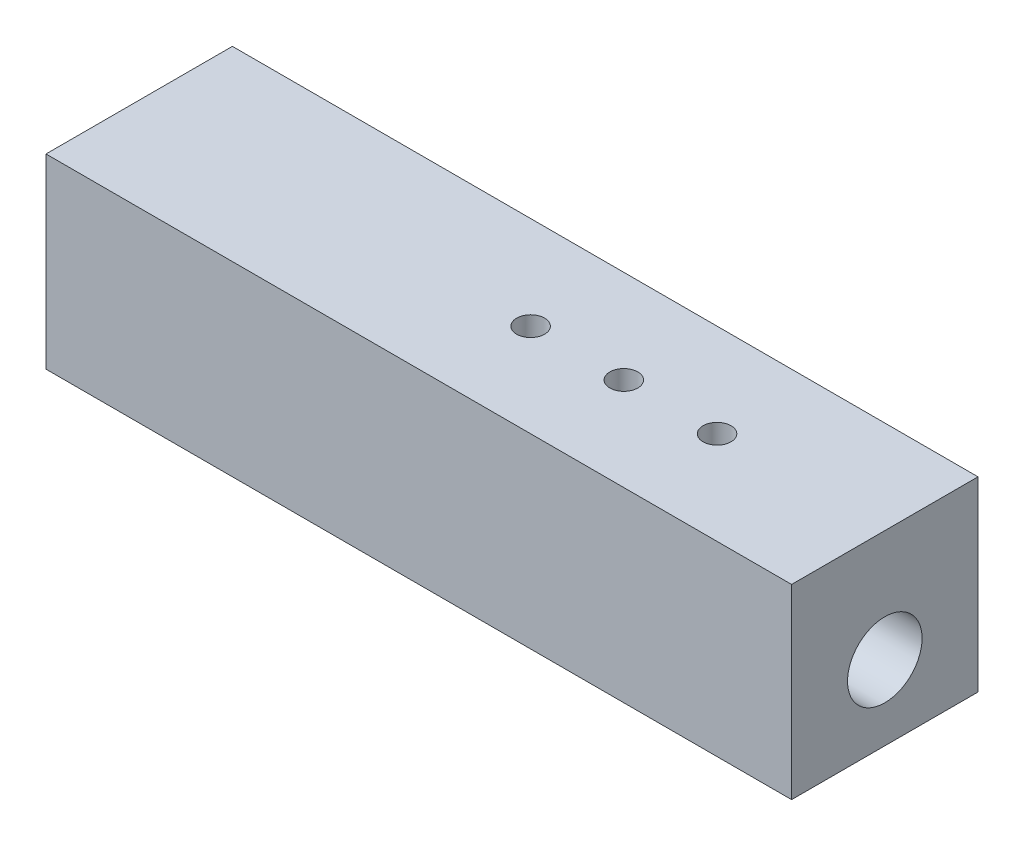
ISO-10303-21;
HEADER;
FILE_DESCRIPTION(('STEP AP214'),'2;1');
FILE_NAME('part.step','',(''),(''),'','','');
FILE_SCHEMA(('AUTOMOTIVE_DESIGN { 1 0 10303 214 1 1 1 1 }'));
ENDSEC;
DATA;
#1=APPLICATION_CONTEXT('core data for automotive mechanical design processes');
#2=APPLICATION_PROTOCOL_DEFINITION('international standard','automotive_design',2000,#1);
#3=PRODUCT_CONTEXT('',#1,'mechanical');
#4=PRODUCT('Part','Part','',(#3));
#5=PRODUCT_RELATED_PRODUCT_CATEGORY('part','',(#4));
#6=PRODUCT_DEFINITION_FORMATION('','',#4);
#7=PRODUCT_DEFINITION_CONTEXT('part definition',#1,'design');
#8=PRODUCT_DEFINITION('design','',#6,#7);
#9=PRODUCT_DEFINITION_SHAPE('','',#8);
#10=(LENGTH_UNIT() NAMED_UNIT(*) SI_UNIT(.MILLI.,.METRE.));
#11=(NAMED_UNIT(*) PLANE_ANGLE_UNIT() SI_UNIT($,.RADIAN.));
#12=(NAMED_UNIT(*) SI_UNIT($,.STERADIAN.) SOLID_ANGLE_UNIT());
#13=UNCERTAINTY_MEASURE_WITH_UNIT(LENGTH_MEASURE(1.E-05),#10,'distance_accuracy_value','');
#14=(GEOMETRIC_REPRESENTATION_CONTEXT(3) GLOBAL_UNCERTAINTY_ASSIGNED_CONTEXT((#13)) GLOBAL_UNIT_ASSIGNED_CONTEXT((#10,
#11,#12)) REPRESENTATION_CONTEXT('',''));
#15=CARTESIAN_POINT('',(0.,0.,0.));
#16=DIRECTION('',(0.,0.,1.));
#17=DIRECTION('',(1.,0.,0.));
#18=AXIS2_PLACEMENT_3D('',#15,#16,#17);
#19=CARTESIAN_POINT('',(-20.,10.,-5.));
#20=DIRECTION('',(1.,0.,0.));
#21=DIRECTION('',(0.,0.,-1.));
#22=AXIS2_PLACEMENT_3D('',#19,#20,#21);
#23=PLANE('',#22);
#24=CARTESIAN_POINT('',(-20.,4.,0.));
#25=DIRECTION('',(1.,0.,0.));
#26=DIRECTION('',(0.,0.,-1.));
#27=AXIS2_PLACEMENT_3D('',#24,#25,#26);
#28=CIRCLE('',#27,2.);
#29=CARTESIAN_POINT('',(-20.,4.,-2.));
#30=VERTEX_POINT('',#29);
#31=EDGE_CURVE('E99',#30,#30,#28,.T.);
#32=ORIENTED_EDGE('',*,*,#31,.T.);
#33=EDGE_LOOP('',(#32));
#34=FACE_BOUND('',#33,.T.);
#35=DIRECTION('',(0.,0.,1.));
#36=VECTOR('',#35,1.);
#37=CARTESIAN_POINT('',(-20.,0.,-5.));
#38=LINE('',#37,#36);
#39=CARTESIAN_POINT('',(-20.,0.,-5.));
#40=VERTEX_POINT('',#39);
#41=CARTESIAN_POINT('',(-20.,0.,5.));
#42=VERTEX_POINT('',#41);
#43=EDGE_CURVE('E96',#40,#42,#38,.T.);
#44=ORIENTED_EDGE('',*,*,#43,.T.);
#45=DIRECTION('',(0.,-1.,0.));
#46=VECTOR('',#45,1.);
#47=CARTESIAN_POINT('',(-20.,10.,5.));
#48=LINE('',#47,#46);
#49=CARTESIAN_POINT('',(-20.,10.,5.));
#50=VERTEX_POINT('',#49);
#51=EDGE_CURVE('E11',#50,#42,#48,.T.);
#52=ORIENTED_EDGE('',*,*,#51,.F.);
#53=DIRECTION('',(0.,0.,1.));
#54=VECTOR('',#53,1.);
#55=CARTESIAN_POINT('',(-20.,10.,-5.));
#56=LINE('',#55,#54);
#57=CARTESIAN_POINT('',(-20.,10.,-5.));
#58=VERTEX_POINT('',#57);
#59=EDGE_CURVE('E84',#58,#50,#56,.T.);
#60=ORIENTED_EDGE('',*,*,#59,.F.);
#61=DIRECTION('',(0.,-1.,0.));
#62=VECTOR('',#61,1.);
#63=CARTESIAN_POINT('',(-20.,10.,-5.));
#64=LINE('',#63,#62);
#65=EDGE_CURVE('E92',#58,#40,#64,.T.);
#66=ORIENTED_EDGE('',*,*,#65,.T.);
#67=EDGE_LOOP('',(#44,#52,#60,#66));
#68=FACE_BOUND('',#67,.T.);
#69=ADVANCED_FACE('F33',(#34,#68),#23,.F.);
#70=CARTESIAN_POINT('',(20.,10.,5.));
#71=DIRECTION('',(0.,0.,-1.));
#72=DIRECTION('',(-1.,0.,0.));
#73=AXIS2_PLACEMENT_3D('',#70,#71,#72);
#74=PLANE('',#73);
#75=DIRECTION('',(1.,0.,0.));
#76=VECTOR('',#75,1.);
#77=CARTESIAN_POINT('',(20.,0.,5.));
#78=LINE('',#77,#76);
#79=CARTESIAN_POINT('',(20.,0.,5.));
#80=VERTEX_POINT('',#79);
#81=EDGE_CURVE('E88',#42,#80,#78,.T.);
#82=ORIENTED_EDGE('',*,*,#81,.T.);
#83=DIRECTION('',(0.,-1.,0.));
#84=VECTOR('',#83,1.);
#85=CARTESIAN_POINT('',(20.,10.,5.));
#86=LINE('',#85,#84);
#87=CARTESIAN_POINT('',(20.,10.,5.));
#88=VERTEX_POINT('',#87);
#89=EDGE_CURVE('E41',#88,#80,#86,.T.);
#90=ORIENTED_EDGE('',*,*,#89,.F.);
#91=DIRECTION('',(1.,0.,0.));
#92=VECTOR('',#91,1.);
#93=CARTESIAN_POINT('',(20.,10.,5.));
#94=LINE('',#93,#92);
#95=EDGE_CURVE('E79',#50,#88,#94,.T.);
#96=ORIENTED_EDGE('',*,*,#95,.F.);
#97=ORIENTED_EDGE('',*,*,#51,.T.);
#98=EDGE_LOOP('',(#82,#90,#96,#97));
#99=FACE_BOUND('',#98,.T.);
#100=ADVANCED_FACE('F87',(#99),#74,.F.);
#101=CARTESIAN_POINT('',(20.,10.,-5.));
#102=DIRECTION('',(-1.,0.,0.));
#103=DIRECTION('',(0.,0.,1.));
#104=AXIS2_PLACEMENT_3D('',#101,#102,#103);
#105=PLANE('',#104);
#106=CARTESIAN_POINT('',(20.,4.,0.));
#107=DIRECTION('',(1.,0.,0.));
#108=DIRECTION('',(0.,0.,-1.));
#109=AXIS2_PLACEMENT_3D('',#106,#107,#108);
#110=CIRCLE('',#109,2.);
#111=CARTESIAN_POINT('',(20.,4.,-2.));
#112=VERTEX_POINT('',#111);
#113=EDGE_CURVE('E110',#112,#112,#110,.T.);
#114=ORIENTED_EDGE('',*,*,#113,.F.);
#115=EDGE_LOOP('',(#114));
#116=FACE_BOUND('',#115,.T.);
#117=DIRECTION('',(0.,0.,-1.));
#118=VECTOR('',#117,1.);
#119=CARTESIAN_POINT('',(20.,0.,-5.));
#120=LINE('',#119,#118);
#121=CARTESIAN_POINT('',(20.,0.,-5.));
#122=VERTEX_POINT('',#121);
#123=EDGE_CURVE('E66',#80,#122,#120,.T.);
#124=ORIENTED_EDGE('',*,*,#123,.T.);
#125=DIRECTION('',(0.,-1.,0.));
#126=VECTOR('',#125,1.);
#127=CARTESIAN_POINT('',(20.,10.,-5.));
#128=LINE('',#127,#126);
#129=CARTESIAN_POINT('',(20.,10.,-5.));
#130=VERTEX_POINT('',#129);
#131=EDGE_CURVE('E89',#130,#122,#128,.T.);
#132=ORIENTED_EDGE('',*,*,#131,.F.);
#133=DIRECTION('',(0.,0.,-1.));
#134=VECTOR('',#133,1.);
#135=CARTESIAN_POINT('',(20.,10.,-5.));
#136=LINE('',#135,#134);
#137=EDGE_CURVE('E82',#88,#130,#136,.T.);
#138=ORIENTED_EDGE('',*,*,#137,.F.);
#139=ORIENTED_EDGE('',*,*,#89,.T.);
#140=EDGE_LOOP('',(#124,#132,#138,#139));
#141=FACE_BOUND('',#140,.T.);
#142=ADVANCED_FACE('F90',(#116,#141),#105,.F.);
#143=CARTESIAN_POINT('',(20.,10.,-5.));
#144=DIRECTION('',(0.,0.,1.));
#145=DIRECTION('',(1.,0.,0.));
#146=AXIS2_PLACEMENT_3D('',#143,#144,#145);
#147=PLANE('',#146);
#148=DIRECTION('',(-1.,0.,0.));
#149=VECTOR('',#148,1.);
#150=CARTESIAN_POINT('',(20.,0.,-5.));
#151=LINE('',#150,#149);
#152=EDGE_CURVE('E72',#122,#40,#151,.T.);
#153=ORIENTED_EDGE('',*,*,#152,.T.);
#154=ORIENTED_EDGE('',*,*,#65,.F.);
#155=DIRECTION('',(-1.,0.,0.));
#156=VECTOR('',#155,1.);
#157=CARTESIAN_POINT('',(20.,10.,-5.));
#158=LINE('',#157,#156);
#159=EDGE_CURVE('E49',#130,#58,#158,.T.);
#160=ORIENTED_EDGE('',*,*,#159,.F.);
#161=ORIENTED_EDGE('',*,*,#131,.T.);
#162=EDGE_LOOP('',(#153,#154,#160,#161));
#163=FACE_BOUND('',#162,.T.);
#164=ADVANCED_FACE('F104',(#163),#147,.F.);
#165=CARTESIAN_POINT('',(0.,10.,0.));
#166=DIRECTION('',(0.,-1.,0.));
#167=DIRECTION('',(0.,0.,-1.));
#168=AXIS2_PLACEMENT_3D('',#165,#166,#167);
#169=PLANE('',#168);
#170=CARTESIAN_POINT('',(11.,10.,0.));
#171=DIRECTION('',(0.,1.,0.));
#172=DIRECTION('',(0.,0.,1.));
#173=AXIS2_PLACEMENT_3D('',#170,#171,#172);
#174=CIRCLE('',#173,0.75);
#175=CARTESIAN_POINT('',(11.,10.,0.75));
#176=VERTEX_POINT('',#175);
#177=EDGE_CURVE('E113',#176,#176,#174,.T.);
#178=ORIENTED_EDGE('',*,*,#177,.F.);
#179=EDGE_LOOP('',(#178));
#180=FACE_BOUND('',#179,.T.);
#181=CARTESIAN_POINT('',(6.,10.,0.));
#182=DIRECTION('',(0.,1.,0.));
#183=DIRECTION('',(0.,0.,1.));
#184=AXIS2_PLACEMENT_3D('',#181,#182,#183);
#185=CIRCLE('',#184,0.750000000000001);
#186=CARTESIAN_POINT('',(6.,10.,0.750000000000001));
#187=VERTEX_POINT('',#186);
#188=EDGE_CURVE('E127',#187,#187,#185,.T.);
#189=ORIENTED_EDGE('',*,*,#188,.F.);
#190=EDGE_LOOP('',(#189));
#191=FACE_BOUND('',#190,.T.);
#192=CARTESIAN_POINT('',(1.,10.,0.));
#193=DIRECTION('',(0.,1.,0.));
#194=DIRECTION('',(0.,0.,1.));
#195=AXIS2_PLACEMENT_3D('',#192,#193,#194);
#196=CIRCLE('',#195,0.75);
#197=CARTESIAN_POINT('',(1.,10.,0.75));
#198=VERTEX_POINT('',#197);
#199=EDGE_CURVE('E116',#198,#198,#196,.T.);
#200=ORIENTED_EDGE('',*,*,#199,.F.);
#201=EDGE_LOOP('',(#200));
#202=FACE_BOUND('',#201,.T.);
#203=ORIENTED_EDGE('',*,*,#59,.T.);
#204=ORIENTED_EDGE('',*,*,#95,.T.);
#205=ORIENTED_EDGE('',*,*,#137,.T.);
#206=ORIENTED_EDGE('',*,*,#159,.T.);
#207=EDGE_LOOP('',(#203,#204,#205,#206));
#208=FACE_BOUND('',#207,.T.);
#209=ADVANCED_FACE('F80',(#180,#191,#202,#208),#169,.F.);
#210=CARTESIAN_POINT('',(0.,0.,0.));
#211=DIRECTION('',(0.,-1.,0.));
#212=DIRECTION('',(0.,0.,-1.));
#213=AXIS2_PLACEMENT_3D('',#210,#211,#212);
#214=PLANE('',#213);
#215=ORIENTED_EDGE('',*,*,#43,.F.);
#216=ORIENTED_EDGE('',*,*,#152,.F.);
#217=ORIENTED_EDGE('',*,*,#123,.F.);
#218=ORIENTED_EDGE('',*,*,#81,.F.);
#219=EDGE_LOOP('',(#215,#216,#217,#218));
#220=FACE_BOUND('',#219,.T.);
#221=ADVANCED_FACE('F107',(#220),#214,.T.);
#222=CARTESIAN_POINT('',(-20.,4.,0.));
#223=DIRECTION('',(1.,0.,0.));
#224=DIRECTION('',(0.,0.,-1.));
#225=AXIS2_PLACEMENT_3D('',#222,#223,#224);
#226=CYLINDRICAL_SURFACE('',#225,2.);
#227=CARTESIAN_POINT('',(11.,5.85404962177392,0.75));
#228=CARTESIAN_POINT('',(10.9594962581396,5.85404820316903,0.750001520530547));
#229=CARTESIAN_POINT('',(10.9190025387482,5.85539130120493,0.746707987747437));
#230=CARTESIAN_POINT('',(10.8392359585434,5.86058079652483,0.733680939477339));
#231=CARTESIAN_POINT('',(10.7999630612025,5.86442711883556,0.723947616866316));
#232=CARTESIAN_POINT('',(10.7238123141932,5.8741274014045,0.698448288052869));
#233=CARTESIAN_POINT('',(10.6869289716745,5.8799765478463,0.682696736331742));
#234=CARTESIAN_POINT('',(10.6163140515906,5.89301567103299,0.645659283713488));
#235=CARTESIAN_POINT('',(10.5825834248587,5.90020605033662,0.624371720475193));
#236=CARTESIAN_POINT('',(10.5175548441886,5.91551787332856,0.57573330687081));
#237=CARTESIAN_POINT('',(10.4864357351853,5.92366670961802,0.548151906066532));
#238=CARTESIAN_POINT('',(10.4291385926643,5.93974875314273,0.488197919889463));
#239=CARTESIAN_POINT('',(10.4029616131291,5.94768191407392,0.45582431512834));
#240=CARTESIAN_POINT('',(10.3554302438522,5.96276436968276,0.385847327588801));
#241=CARTESIAN_POINT('',(10.3342702626421,5.96987780611753,0.348103473769015));
#242=CARTESIAN_POINT('',(10.2986744137375,5.98219003986924,0.269277885982624));
#243=CARTESIAN_POINT('',(10.284236214004,5.98738950108503,0.228197315466768));
#244=CARTESIAN_POINT('',(10.2631210521127,5.9950934855172,0.145744670838416));
#245=CARTESIAN_POINT('',(10.2561361862798,5.99770457607387,0.104461598640798));
#246=CARTESIAN_POINT('',(10.2491393995275,6.0003200705397,0.021232181897393));
#247=CARTESIAN_POINT('',(10.2491252111906,6.00032532207451,-0.0207139425314167));
#248=CARTESIAN_POINT('',(10.2558908807326,5.99779632951947,-0.101871771532238));
#249=CARTESIAN_POINT('',(10.2623346489744,5.99538770998342,-0.14111608913345));
#250=CARTESIAN_POINT('',(10.2812679576128,5.98846637466131,-0.217919608992196));
#251=CARTESIAN_POINT('',(10.293757926131,5.98395350987789,-0.255478691715149));
#252=CARTESIAN_POINT('',(10.3245852258379,5.97318884583765,-0.328494508651552));
#253=CARTESIAN_POINT('',(10.3430050026342,5.96691269735038,-0.363912696143655));
#254=CARTESIAN_POINT('',(10.3850960484647,5.9532565511264,-0.43124330397878));
#255=CARTESIAN_POINT('',(10.4087690115088,5.9458761975642,-0.463154588466162));
#256=CARTESIAN_POINT('',(10.4623136431416,5.93026264827908,-0.524545243400468));
#257=CARTESIAN_POINT('',(10.4924669578252,5.92200481881941,-0.553773072631741));
#258=CARTESIAN_POINT('',(10.5572964966608,5.90591230322861,-0.606851977846712));
#259=CARTESIAN_POINT('',(10.5919738532933,5.89807772374424,-0.630701703464499));
#260=CARTESIAN_POINT('',(10.6658597337314,5.88356351750168,-0.672828059040758));
#261=CARTESIAN_POINT('',(10.705151746843,5.87691338575138,-0.690969239259154));
#262=CARTESIAN_POINT('',(10.7865481125838,5.86586219314501,-0.720282322207506));
#263=CARTESIAN_POINT('',(10.8286508857968,5.86145988102891,-0.731458103027975));
#264=CARTESIAN_POINT('',(10.911987981158,5.85569798611424,-0.745950958548341));
#265=CARTESIAN_POINT('',(10.9531420527681,5.85418392620768,-0.74966760579483));
#266=CARTESIAN_POINT('',(11.0355046783709,5.85393269762508,-0.750289428181361));
#267=CARTESIAN_POINT('',(11.0767132161762,5.85519483501993,-0.747196305468809));
#268=CARTESIAN_POINT('',(11.1559649611438,5.86019690814867,-0.734648667600785));
#269=CARTESIAN_POINT('',(11.1940655678823,5.86381638108224,-0.725503091671123));
#270=CARTESIAN_POINT('',(11.2681739723601,5.87298243523181,-0.701498873203188));
#271=CARTESIAN_POINT('',(11.3041813395841,5.87852941125086,-0.686639060173115));
#272=CARTESIAN_POINT('',(11.3745822190381,5.8911812155804,-0.651001461376389));
#273=CARTESIAN_POINT('',(11.4088646460687,5.89833664446032,-0.630022725885234));
#274=CARTESIAN_POINT('',(11.473564490863,5.91331407147146,-0.582956589312396));
#275=CARTESIAN_POINT('',(11.5039804873123,5.92113631297039,-0.556867318482174));
#276=CARTESIAN_POINT('',(11.5620841865976,5.93716523276592,-0.49836367045047));
#277=CARTESIAN_POINT('',(11.5894767043844,5.94536484678514,-0.465653170745532));
#278=CARTESIAN_POINT('',(11.6384191837947,5.96074937481651,-0.395898735876576));
#279=CARTESIAN_POINT('',(11.6599691264729,5.96793428553832,-0.358854786661337));
#280=CARTESIAN_POINT('',(11.6964730280998,5.98047492852276,-0.281508164734238));
#281=CARTESIAN_POINT('',(11.7114495618963,5.98583690669005,-0.241217216532313));
#282=CARTESIAN_POINT('',(11.734328206925,5.99414718356286,-0.158440943761627));
#283=CARTESIAN_POINT('',(11.7422336427112,5.99709661649706,-0.115956660361796));
#284=CARTESIAN_POINT('',(11.7503872013774,6.00014203658537,-0.0326677926369078));
#285=CARTESIAN_POINT('',(11.7510547415295,6.00039430476882,0.00809038403042252));
#286=CARTESIAN_POINT('',(11.7457924202773,5.99842444904612,0.0891133932062117));
#287=CARTESIAN_POINT('',(11.7398633545571,5.99620262356565,0.129378284622628));
#288=CARTESIAN_POINT('',(11.7218705742532,5.98960544801886,0.207274124188563));
#289=CARTESIAN_POINT('',(11.7099600470608,5.98528395689009,0.244945365534417));
#290=CARTESIAN_POINT('',(11.6804949933078,5.97493891810495,0.317757736503194));
#291=CARTESIAN_POINT('',(11.6629393983476,5.96891504827832,0.352898385637771));
#292=CARTESIAN_POINT('',(11.6218430282476,5.95545309150037,0.421270088497206));
#293=CARTESIAN_POINT('',(11.5980816797429,5.94796620054414,0.454358774423425));
#294=CARTESIAN_POINT('',(11.5455960849062,5.93249753847422,0.516208673761681));
#295=CARTESIAN_POINT('',(11.5168700670961,5.92451559137014,0.54496833562795));
#296=CARTESIAN_POINT('',(11.4534679341775,5.90844064869588,0.598906071180978));
#297=CARTESIAN_POINT('',(11.4185577989228,5.9003640267458,0.623814999080126));
#298=CARTESIAN_POINT('',(11.3447920652133,5.88549162501819,0.667423547784217));
#299=CARTESIAN_POINT('',(11.3059360579733,5.87869597815608,0.686122524390784));
#300=CARTESIAN_POINT('',(11.2235221595123,5.86701134926633,0.717329434871302));
#301=CARTESIAN_POINT('',(11.1798328167441,5.8622190164543,0.729530014497614));
#302=CARTESIAN_POINT('',(11.0907573640221,5.85573997168158,0.745861783610396));
#303=CARTESIAN_POINT('',(11.045372393645,5.85405121089868,0.749998296697853));
#304=CARTESIAN_POINT('',(11.,5.85404962177392,0.75));
#305=B_SPLINE_CURVE_WITH_KNOTS('',3,(#227,#228,#229,#230,#231,#232,#233,#234,#235,#236,#237,
#238,#239,#240,#241,#242,#243,#244,#245,#246,#247,#248,#249,#250,#251,#252,#253,#254,#255,#256,
#257,#258,#259,#260,#261,#262,#263,#264,#265,#266,#267,#268,#269,#270,#271,#272,#273,#274,#275,
#276,#277,#278,#279,#280,#281,#282,#283,#284,#285,#286,#287,#288,#289,#290,#291,#292,#293,#294,
#295,#296,#297,#298,#299,#300,#301,#302,#303,#304),.UNSPECIFIED.,.T.,.F.,(4,2,2,2,2,2,2,2,2,2,2,
2,2,2,2,2,2,2,2,2,2,2,2,2,2,2,2,2,2,2,2,2,2,2,2,2,2,2,4),(0.,0.121342270708086,
0.242680907299427,0.363729928378516,0.484815339841467,0.611373262005639,0.737958144114914,
0.868850360682105,0.99969713190665,1.1249000924484,1.25006232702429,1.36903236401597,
1.48801082631668,1.60872065605334,1.72946946814488,1.85728337532937,1.98512933913667,
2.11581296126483,2.24642375817737,2.36982828870243,2.49320197694442,2.61071922964099,
2.72826056714763,2.85020780502911,2.97219974233178,3.10192508496812,3.23165084825089,
3.36092754445084,3.49014342780064,3.61182860274968,3.7334991015974,3.85220137001945,
3.97092611756416,4.09464161838493,4.21840135447482,4.3486929977104,4.47899815272121,
4.61501589435463,4.75094381161527),.UNSPECIFIED.);
#306=CARTESIAN_POINT('',(11.,5.85404962177392,0.75));
#307=VERTEX_POINT('',#306);
#308=EDGE_CURVE('E148',#307,#307,#305,.T.);
#309=ORIENTED_EDGE('',*,*,#308,.F.);
#310=EDGE_LOOP('',(#309));
#311=FACE_BOUND('',#310,.T.);
#312=CARTESIAN_POINT('',(6.,5.85404962177392,0.750000000000001));
#313=CARTESIAN_POINT('',(5.95949625813961,5.85404820316903,0.750001520530547));
#314=CARTESIAN_POINT('',(5.91900253874818,5.85539130120493,0.746707987747437));
#315=CARTESIAN_POINT('',(5.8392359585434,5.86058079652483,0.73368093947734));
#316=CARTESIAN_POINT('',(5.79996306120249,5.86442711883556,0.723947616866317));
#317=CARTESIAN_POINT('',(5.72381231419324,5.8741274014045,0.69844828805287));
#318=CARTESIAN_POINT('',(5.68692897167446,5.8799765478463,0.682696736331742));
#319=CARTESIAN_POINT('',(5.61631405159058,5.89301567103299,0.645659283713488));
#320=CARTESIAN_POINT('',(5.58258342485874,5.90020605033662,0.624371720475193));
#321=CARTESIAN_POINT('',(5.51755484418859,5.91551787332856,0.57573330687081));
#322=CARTESIAN_POINT('',(5.4864357351853,5.92366670961802,0.548151906066531));
#323=CARTESIAN_POINT('',(5.42913859266426,5.93974875314273,0.488197919889463));
#324=CARTESIAN_POINT('',(5.40296161312907,5.94768191407393,0.45582431512834));
#325=CARTESIAN_POINT('',(5.35543024385219,5.96276436968277,0.3858473275888));
#326=CARTESIAN_POINT('',(5.33427026264207,5.96987780611753,0.348103473769014));
#327=CARTESIAN_POINT('',(5.29867441373754,5.98219003986924,0.269277885982623));
#328=CARTESIAN_POINT('',(5.28423621400401,5.98738950108503,0.228197315466767));
#329=CARTESIAN_POINT('',(5.26312105211269,5.9950934855172,0.145744670838415));
#330=CARTESIAN_POINT('',(5.25613618627977,5.99770457607387,0.104461598640797));
#331=CARTESIAN_POINT('',(5.24913939952751,6.0003200705397,0.0212321818973921));
#332=CARTESIAN_POINT('',(5.24912521119064,6.00032532207451,-0.0207139425314175));
#333=CARTESIAN_POINT('',(5.25589088073259,5.99779632951947,-0.101871771532239));
#334=CARTESIAN_POINT('',(5.26233464897441,5.99538770998342,-0.141116089133451));
#335=CARTESIAN_POINT('',(5.28126795761278,5.98846637466131,-0.217919608992197));
#336=CARTESIAN_POINT('',(5.29375792613102,5.98395350987789,-0.25547869171515));
#337=CARTESIAN_POINT('',(5.32458522583792,5.97318884583765,-0.328494508651553));
#338=CARTESIAN_POINT('',(5.3430050026342,5.96691269735038,-0.363912696143656));
#339=CARTESIAN_POINT('',(5.38509604846469,5.9532565511264,-0.431243303978781));
#340=CARTESIAN_POINT('',(5.4087690115088,5.9458761975642,-0.463154588466163));
#341=CARTESIAN_POINT('',(5.46231364314159,5.93026264827908,-0.524545243400469));
#342=CARTESIAN_POINT('',(5.49246695782521,5.92200481881941,-0.553773072631741));
#343=CARTESIAN_POINT('',(5.55729649666078,5.90591230322861,-0.606851977846713));
#344=CARTESIAN_POINT('',(5.59197385329332,5.89807772374424,-0.6307017034645));
#345=CARTESIAN_POINT('',(5.66585973373141,5.88356351750168,-0.672828059040759));
#346=CARTESIAN_POINT('',(5.70515174684303,5.87691338575138,-0.690969239259155));
#347=CARTESIAN_POINT('',(5.78654811258379,5.86586219314501,-0.720282322207507));
#348=CARTESIAN_POINT('',(5.82865088579685,5.86145988102891,-0.731458103027976));
#349=CARTESIAN_POINT('',(5.91198798115798,5.85569798611424,-0.745950958548342));
#350=CARTESIAN_POINT('',(5.95314205276807,5.85418392620768,-0.749667605794831));
#351=CARTESIAN_POINT('',(6.03550467837087,5.85393269762508,-0.750289428181362));
#352=CARTESIAN_POINT('',(6.07671321617624,5.85519483501993,-0.74719630546881));
#353=CARTESIAN_POINT('',(6.15596496114384,5.86019690814867,-0.734648667600785));
#354=CARTESIAN_POINT('',(6.19406556788233,5.86381638108224,-0.725503091671123));
#355=CARTESIAN_POINT('',(6.2681739723601,5.87298243523181,-0.701498873203188));
#356=CARTESIAN_POINT('',(6.30418133958407,5.87852941125086,-0.686639060173115));
#357=CARTESIAN_POINT('',(6.37458221903811,5.8911812155804,-0.651001461376389));
#358=CARTESIAN_POINT('',(6.40886464606867,5.89833664446032,-0.630022725885234));
#359=CARTESIAN_POINT('',(6.47356449086302,5.91331407147146,-0.582956589312395));
#360=CARTESIAN_POINT('',(6.50398048731232,5.92113631297039,-0.556867318482173));
#361=CARTESIAN_POINT('',(6.56208418659755,5.93716523276592,-0.498363670450469));
#362=CARTESIAN_POINT('',(6.58947670438438,5.94536484678514,-0.46565317074553));
#363=CARTESIAN_POINT('',(6.63841918379472,5.96074937481651,-0.395898735876575));
#364=CARTESIAN_POINT('',(6.65996912647292,5.96793428553832,-0.358854786661337));
#365=CARTESIAN_POINT('',(6.69647302809981,5.98047492852276,-0.281508164734239));
#366=CARTESIAN_POINT('',(6.7114495618963,5.98583690669005,-0.241217216532313));
#367=CARTESIAN_POINT('',(6.73432820692496,5.99414718356286,-0.158440943761627));
#368=CARTESIAN_POINT('',(6.7422336427112,5.99709661649706,-0.115956660361796));
#369=CARTESIAN_POINT('',(6.75038720137742,6.00014203658537,-0.0326677926369073));
#370=CARTESIAN_POINT('',(6.7510547415295,6.00039430476882,0.00809038403042297));
#371=CARTESIAN_POINT('',(6.7457924202773,5.99842444904612,0.0891133932062123));
#372=CARTESIAN_POINT('',(6.73986335455707,5.99620262356565,0.129378284622629));
#373=CARTESIAN_POINT('',(6.72187057425319,5.98960544801886,0.207274124188564));
#374=CARTESIAN_POINT('',(6.70996004706082,5.98528395689009,0.244945365534418));
#375=CARTESIAN_POINT('',(6.68049499330782,5.97493891810495,0.317757736503196));
#376=CARTESIAN_POINT('',(6.66293939834762,5.96891504827832,0.352898385637772));
#377=CARTESIAN_POINT('',(6.6218430282476,5.95545309150037,0.421270088497207));
#378=CARTESIAN_POINT('',(6.59808167974293,5.94796620054414,0.454358774423426));
#379=CARTESIAN_POINT('',(6.5455960849062,5.93249753847422,0.516208673761682));
#380=CARTESIAN_POINT('',(6.51687006709606,5.92451559137013,0.54496833562795));
#381=CARTESIAN_POINT('',(6.45346793417747,5.90844064869588,0.598906071180979));
#382=CARTESIAN_POINT('',(6.41855779892285,5.9003640267458,0.623814999080126));
#383=CARTESIAN_POINT('',(6.34479206521334,5.88549162501819,0.667423547784217));
#384=CARTESIAN_POINT('',(6.30593605797326,5.87869597815608,0.686122524390785));
#385=CARTESIAN_POINT('',(6.2235221595123,5.86701134926633,0.717329434871303));
#386=CARTESIAN_POINT('',(6.17983281674411,5.8622190164543,0.729530014497614));
#387=CARTESIAN_POINT('',(6.09075736402211,5.85573997168158,0.745861783610397));
#388=CARTESIAN_POINT('',(6.04537239364501,5.85405121089868,0.749998296697854));
#389=CARTESIAN_POINT('',(6.,5.85404962177392,0.750000000000001));
#390=B_SPLINE_CURVE_WITH_KNOTS('',3,(#312,#313,#314,#315,#316,#317,#318,#319,#320,#321,#322,
#323,#324,#325,#326,#327,#328,#329,#330,#331,#332,#333,#334,#335,#336,#337,#338,#339,#340,#341,
#342,#343,#344,#345,#346,#347,#348,#349,#350,#351,#352,#353,#354,#355,#356,#357,#358,#359,#360,
#361,#362,#363,#364,#365,#366,#367,#368,#369,#370,#371,#372,#373,#374,#375,#376,#377,#378,#379,
#380,#381,#382,#383,#384,#385,#386,#387,#388,#389),.UNSPECIFIED.,.T.,.F.,(4,2,2,2,2,2,2,2,2,2,2,
2,2,2,2,2,2,2,2,2,2,2,2,2,2,2,2,2,2,2,2,2,2,2,2,2,2,2,4),(0.,0.121342270708086,
0.242680907299428,0.363729928378517,0.484815339841468,0.611373262005641,0.737958144114916,
0.868850360682107,0.999697131906652,1.1249000924484,1.25006232702429,1.36903236401597,
1.48801082631668,1.60872065605334,1.72946946814488,1.85728337532937,1.98512933913668,
2.11581296126484,2.24642375817737,2.36982828870243,2.49320197694443,2.610719229641,
2.72826056714764,2.85020780502911,2.97219974233178,3.10192508496812,3.23165084825089,
3.36092754445085,3.49014342780064,3.61182860274968,3.7334991015974,3.85220137001946,
3.97092611756416,4.09464161838494,4.21840135447483,4.3486929977104,4.47899815272122,
4.61501589435464,4.75094381161527),.UNSPECIFIED.);
#391=CARTESIAN_POINT('',(6.,5.85404962177392,0.750000000000001));
#392=VERTEX_POINT('',#391);
#393=EDGE_CURVE('E119',#392,#392,#390,.T.);
#394=ORIENTED_EDGE('',*,*,#393,.F.);
#395=EDGE_LOOP('',(#394));
#396=FACE_BOUND('',#395,.T.);
#397=CARTESIAN_POINT('',(1.,5.85404962177392,0.75));
#398=CARTESIAN_POINT('',(0.959496258139606,5.85404820316903,0.750001520530547));
#399=CARTESIAN_POINT('',(0.919002538748183,5.85539130120493,0.746707987747436));
#400=CARTESIAN_POINT('',(0.8392359585434,5.86058079652483,0.733680939477339));
#401=CARTESIAN_POINT('',(0.799963061202495,5.86442711883556,0.723947616866316));
#402=CARTESIAN_POINT('',(0.723812314193237,5.8741274014045,0.698448288052869));
#403=CARTESIAN_POINT('',(0.686928971674459,5.8799765478463,0.682696736331742));
#404=CARTESIAN_POINT('',(0.61631405159058,5.89301567103299,0.645659283713488));
#405=CARTESIAN_POINT('',(0.582583424858741,5.90020605033662,0.624371720475193));
#406=CARTESIAN_POINT('',(0.517554844188592,5.91551787332856,0.57573330687081));
#407=CARTESIAN_POINT('',(0.486435735185304,5.92366670961802,0.548151906066531));
#408=CARTESIAN_POINT('',(0.429138592664256,5.93974875314273,0.488197919889463));
#409=CARTESIAN_POINT('',(0.402961613129073,5.94768191407393,0.45582431512834));
#410=CARTESIAN_POINT('',(0.355430243852195,5.96276436968277,0.3858473275888));
#411=CARTESIAN_POINT('',(0.334270262642072,5.96987780611753,0.348103473769014));
#412=CARTESIAN_POINT('',(0.298674413737545,5.98219003986924,0.269277885982623));
#413=CARTESIAN_POINT('',(0.284236214004013,5.98738950108503,0.228197315466768));
#414=CARTESIAN_POINT('',(0.263121052112692,5.9950934855172,0.145744670838416));
#415=CARTESIAN_POINT('',(0.256136186279772,5.99770457607387,0.104461598640798));
#416=CARTESIAN_POINT('',(0.249139399527506,6.0003200705397,0.0212321818973927));
#417=CARTESIAN_POINT('',(0.249125211190646,6.00032532207451,-0.0207139425314168));
#418=CARTESIAN_POINT('',(0.255890880732587,5.99779632951947,-0.101871771532238));
#419=CARTESIAN_POINT('',(0.262334648974408,5.99538770998342,-0.14111608913345));
#420=CARTESIAN_POINT('',(0.281267957612777,5.98846637466131,-0.217919608992196));
#421=CARTESIAN_POINT('',(0.29375792613102,5.98395350987789,-0.255478691715149));
#422=CARTESIAN_POINT('',(0.324585225837924,5.97318884583765,-0.328494508651552));
#423=CARTESIAN_POINT('',(0.343005002634205,5.96691269735038,-0.363912696143655));
#424=CARTESIAN_POINT('',(0.385096048464695,5.9532565511264,-0.43124330397878));
#425=CARTESIAN_POINT('',(0.408769011508802,5.9458761975642,-0.463154588466162));
#426=CARTESIAN_POINT('',(0.462313643141594,5.93026264827908,-0.524545243400468));
#427=CARTESIAN_POINT('',(0.492466957825214,5.92200481881941,-0.553773072631741));
#428=CARTESIAN_POINT('',(0.557296496660781,5.90591230322861,-0.606851977846712));
#429=CARTESIAN_POINT('',(0.591973853293321,5.89807772374424,-0.630701703464499));
#430=CARTESIAN_POINT('',(0.665859733731412,5.88356351750168,-0.672828059040758));
#431=CARTESIAN_POINT('',(0.705151746843035,5.87691338575138,-0.690969239259154));
#432=CARTESIAN_POINT('',(0.786548112583788,5.86586219314501,-0.720282322207506));
#433=CARTESIAN_POINT('',(0.828650885796846,5.86145988102891,-0.731458103027975));
#434=CARTESIAN_POINT('',(0.911987981157978,5.85569798611424,-0.745950958548341));
#435=CARTESIAN_POINT('',(0.953142052768072,5.85418392620768,-0.74966760579483));
#436=CARTESIAN_POINT('',(1.03550467837087,5.85393269762508,-0.750289428181361));
#437=CARTESIAN_POINT('',(1.07671321617624,5.85519483501993,-0.747196305468809));
#438=CARTESIAN_POINT('',(1.15596496114384,5.86019690814868,-0.734648667600784));
#439=CARTESIAN_POINT('',(1.19406556788233,5.86381638108224,-0.725503091671123));
#440=CARTESIAN_POINT('',(1.2681739723601,5.87298243523181,-0.701498873203188));
#441=CARTESIAN_POINT('',(1.30418133958407,5.87852941125086,-0.686639060173115));
#442=CARTESIAN_POINT('',(1.3745822190381,5.8911812155804,-0.651001461376389));
#443=CARTESIAN_POINT('',(1.40886464606867,5.89833664446032,-0.630022725885234));
#444=CARTESIAN_POINT('',(1.47356449086302,5.91331407147146,-0.582956589312396));
#445=CARTESIAN_POINT('',(1.50398048731232,5.92113631297039,-0.556867318482173));
#446=CARTESIAN_POINT('',(1.56208418659755,5.93716523276592,-0.498363670450469));
#447=CARTESIAN_POINT('',(1.58947670438438,5.94536484678514,-0.465653170745531));
#448=CARTESIAN_POINT('',(1.63841918379472,5.96074937481651,-0.395898735876575));
#449=CARTESIAN_POINT('',(1.65996912647292,5.96793428553832,-0.358854786661336));
#450=CARTESIAN_POINT('',(1.69647302809981,5.98047492852276,-0.281508164734238));
#451=CARTESIAN_POINT('',(1.7114495618963,5.98583690669005,-0.241217216532313));
#452=CARTESIAN_POINT('',(1.73432820692496,5.99414718356286,-0.158440943761627));
#453=CARTESIAN_POINT('',(1.7422336427112,5.99709661649706,-0.115956660361796));
#454=CARTESIAN_POINT('',(1.75038720137741,6.00014203658537,-0.0326677926369076));
#455=CARTESIAN_POINT('',(1.7510547415295,6.00039430476882,0.00809038403042287));
#456=CARTESIAN_POINT('',(1.7457924202773,5.99842444904612,0.0891133932062121));
#457=CARTESIAN_POINT('',(1.73986335455707,5.99620262356565,0.129378284622629));
#458=CARTESIAN_POINT('',(1.72187057425319,5.98960544801886,0.207274124188563));
#459=CARTESIAN_POINT('',(1.70996004706082,5.98528395689009,0.244945365534417));
#460=CARTESIAN_POINT('',(1.68049499330782,5.97493891810495,0.317757736503195));
#461=CARTESIAN_POINT('',(1.66293939834762,5.96891504827832,0.352898385637771));
#462=CARTESIAN_POINT('',(1.6218430282476,5.95545309150037,0.421270088497206));
#463=CARTESIAN_POINT('',(1.59808167974293,5.94796620054414,0.454358774423425));
#464=CARTESIAN_POINT('',(1.5455960849062,5.93249753847422,0.516208673761681));
#465=CARTESIAN_POINT('',(1.51687006709606,5.92451559137014,0.54496833562795));
#466=CARTESIAN_POINT('',(1.45346793417747,5.90844064869588,0.598906071180978));
#467=CARTESIAN_POINT('',(1.41855779892285,5.9003640267458,0.623814999080126));
#468=CARTESIAN_POINT('',(1.34479206521334,5.88549162501819,0.667423547784217));
#469=CARTESIAN_POINT('',(1.30593605797326,5.87869597815608,0.686122524390784));
#470=CARTESIAN_POINT('',(1.2235221595123,5.86701134926633,0.717329434871302));
#471=CARTESIAN_POINT('',(1.17983281674411,5.8622190164543,0.729530014497614));
#472=CARTESIAN_POINT('',(1.09075736402211,5.85573997168158,0.745861783610396));
#473=CARTESIAN_POINT('',(1.045372393645,5.85405121089868,0.749998296697853));
#474=CARTESIAN_POINT('',(1.,5.85404962177392,0.75));
#475=B_SPLINE_CURVE_WITH_KNOTS('',3,(#397,#398,#399,#400,#401,#402,#403,#404,#405,#406,#407,
#408,#409,#410,#411,#412,#413,#414,#415,#416,#417,#418,#419,#420,#421,#422,#423,#424,#425,#426,
#427,#428,#429,#430,#431,#432,#433,#434,#435,#436,#437,#438,#439,#440,#441,#442,#443,#444,#445,
#446,#447,#448,#449,#450,#451,#452,#453,#454,#455,#456,#457,#458,#459,#460,#461,#462,#463,#464,
#465,#466,#467,#468,#469,#470,#471,#472,#473,#474),.UNSPECIFIED.,.T.,.F.,(4,2,2,2,2,2,2,2,2,2,2,
2,2,2,2,2,2,2,2,2,2,2,2,2,2,2,2,2,2,2,2,2,2,2,2,2,2,2,4),(0.,0.121342270708085,
0.242680907299427,0.363729928378515,0.484815339841467,0.61137326200564,0.737958144114915,
0.868850360682106,0.999697131906651,1.1249000924484,1.25006232702429,1.36903236401597,
1.48801082631668,1.60872065605334,1.72946946814488,1.85728337532937,1.98512933913667,
2.11581296126483,2.24642375817737,2.36982828870243,2.49320197694442,2.61071922964099,
2.72826056714763,2.85020780502911,2.97219974233178,3.10192508496812,3.23165084825089,
3.36092754445084,3.49014342780064,3.61182860274968,3.7334991015974,3.85220137001945,
3.97092611756416,4.09464161838493,4.21840135447482,4.3486929977104,4.47899815272121,
4.61501589435463,4.75094381161527),.UNSPECIFIED.);
#476=CARTESIAN_POINT('',(1.,5.85404962177392,0.75));
#477=VERTEX_POINT('',#476);
#478=EDGE_CURVE('E120',#477,#477,#475,.T.);
#479=ORIENTED_EDGE('',*,*,#478,.F.);
#480=EDGE_LOOP('',(#479));
#481=FACE_BOUND('',#480,.T.);
#482=ORIENTED_EDGE('',*,*,#31,.F.);
#483=EDGE_LOOP('',(#482));
#484=FACE_BOUND('',#483,.T.);
#485=ORIENTED_EDGE('',*,*,#113,.T.);
#486=EDGE_LOOP('',(#485));
#487=FACE_BOUND('',#486,.T.);
#488=ADVANCED_FACE('F167',(#311,#396,#481,#484,#487),#226,.F.);
#489=CARTESIAN_POINT('',(1.,-0.000999999999999265,0.));
#490=DIRECTION('',(0.,1.,0.));
#491=DIRECTION('',(0.,0.,1.));
#492=AXIS2_PLACEMENT_3D('',#489,#490,#491);
#493=CYLINDRICAL_SURFACE('',#492,0.75);
#494=ORIENTED_EDGE('',*,*,#199,.T.);
#495=EDGE_LOOP('',(#494));
#496=FACE_BOUND('',#495,.T.);
#497=ORIENTED_EDGE('',*,*,#478,.T.);
#498=EDGE_LOOP('',(#497));
#499=FACE_BOUND('',#498,.T.);
#500=ADVANCED_FACE('F129',(#496,#499),#493,.F.);
#501=CARTESIAN_POINT('',(6.,-0.000999999999999265,0.));
#502=DIRECTION('',(0.,1.,0.));
#503=DIRECTION('',(0.,0.,1.));
#504=AXIS2_PLACEMENT_3D('',#501,#502,#503);
#505=CYLINDRICAL_SURFACE('',#504,0.750000000000001);
#506=ORIENTED_EDGE('',*,*,#188,.T.);
#507=EDGE_LOOP('',(#506));
#508=FACE_BOUND('',#507,.T.);
#509=ORIENTED_EDGE('',*,*,#393,.T.);
#510=EDGE_LOOP('',(#509));
#511=FACE_BOUND('',#510,.T.);
#512=ADVANCED_FACE('F134',(#508,#511),#505,.F.);
#513=CARTESIAN_POINT('',(11.,-0.000999999999999265,0.));
#514=DIRECTION('',(0.,1.,0.));
#515=DIRECTION('',(0.,0.,1.));
#516=AXIS2_PLACEMENT_3D('',#513,#514,#515);
#517=CYLINDRICAL_SURFACE('',#516,0.75);
#518=ORIENTED_EDGE('',*,*,#177,.T.);
#519=EDGE_LOOP('',(#518));
#520=FACE_BOUND('',#519,.T.);
#521=ORIENTED_EDGE('',*,*,#308,.T.);
#522=EDGE_LOOP('',(#521));
#523=FACE_BOUND('',#522,.T.);
#524=ADVANCED_FACE('F138',(#520,#523),#517,.F.);
#525=CLOSED_SHELL('',(#69,#100,#142,#164,#209,#221,#488,#500,#512,#524));
#526=MANIFOLD_SOLID_BREP('B2',#525);
#527=ADVANCED_BREP_SHAPE_REPRESENTATION('',(#18,#526),#14);
#528=SHAPE_DEFINITION_REPRESENTATION(#9,#527);
ENDSEC;
END-ISO-10303-21;
